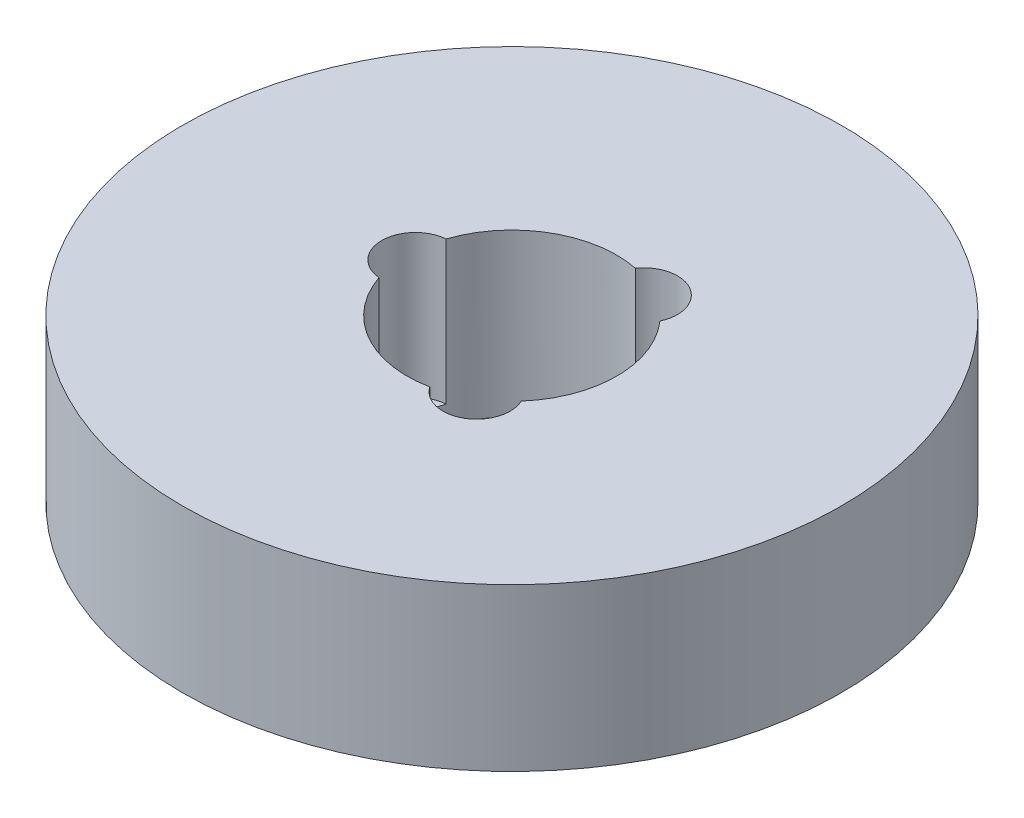
ISO-10303-21;
HEADER;
FILE_DESCRIPTION(('STEP AP214'),'2;1');
FILE_NAME('part.step','',(''),(''),'','','');
FILE_SCHEMA(('AUTOMOTIVE_DESIGN { 1 0 10303 214 1 1 1 1 }'));
ENDSEC;
DATA;
#1=APPLICATION_CONTEXT('core data for automotive mechanical design processes');
#2=APPLICATION_PROTOCOL_DEFINITION('international standard','automotive_design',2000,#1);
#3=PRODUCT_CONTEXT('',#1,'mechanical');
#4=PRODUCT('Part','Part','',(#3));
#5=PRODUCT_RELATED_PRODUCT_CATEGORY('part','',(#4));
#6=PRODUCT_DEFINITION_FORMATION('','',#4);
#7=PRODUCT_DEFINITION_CONTEXT('part definition',#1,'design');
#8=PRODUCT_DEFINITION('design','',#6,#7);
#9=PRODUCT_DEFINITION_SHAPE('','',#8);
#10=(LENGTH_UNIT() NAMED_UNIT(*) SI_UNIT(.MILLI.,.METRE.));
#11=(NAMED_UNIT(*) PLANE_ANGLE_UNIT() SI_UNIT($,.RADIAN.));
#12=(NAMED_UNIT(*) SI_UNIT($,.STERADIAN.) SOLID_ANGLE_UNIT());
#13=UNCERTAINTY_MEASURE_WITH_UNIT(LENGTH_MEASURE(1.E-05),#10,'distance_accuracy_value','');
#14=(GEOMETRIC_REPRESENTATION_CONTEXT(3) GLOBAL_UNCERTAINTY_ASSIGNED_CONTEXT((#13)) GLOBAL_UNIT_ASSIGNED_CONTEXT((#10,
#11,#12)) REPRESENTATION_CONTEXT('',''));
#15=CARTESIAN_POINT('',(0.,0.,0.));
#16=DIRECTION('',(0.,0.,1.));
#17=DIRECTION('',(1.,0.,0.));
#18=AXIS2_PLACEMENT_3D('',#15,#16,#17);
#19=CARTESIAN_POINT('',(0.,27.,0.));
#20=DIRECTION('',(0.,-1.,0.));
#21=DIRECTION('',(0.,0.,-1.));
#22=AXIS2_PLACEMENT_3D('',#19,#20,#21);
#23=CYLINDRICAL_SURFACE('',#22,55.);
#24=CARTESIAN_POINT('',(0.,27.,0.));
#25=DIRECTION('',(0.,1.,0.));
#26=DIRECTION('',(0.,0.,1.));
#27=AXIS2_PLACEMENT_3D('',#24,#25,#26);
#28=CIRCLE('',#27,55.);
#29=CARTESIAN_POINT('',(0.,27.,55.));
#30=VERTEX_POINT('',#29);
#31=EDGE_CURVE('E130',#30,#30,#28,.T.);
#32=ORIENTED_EDGE('',*,*,#31,.F.);
#33=EDGE_LOOP('',(#32));
#34=FACE_BOUND('',#33,.T.);
#35=CARTESIAN_POINT('',(0.,0.,0.));
#36=DIRECTION('',(0.,1.,0.));
#37=DIRECTION('',(0.,0.,1.));
#38=AXIS2_PLACEMENT_3D('',#35,#36,#37);
#39=CIRCLE('',#38,55.);
#40=CARTESIAN_POINT('',(0.,0.,55.));
#41=VERTEX_POINT('',#40);
#42=EDGE_CURVE('E117',#41,#41,#39,.T.);
#43=ORIENTED_EDGE('',*,*,#42,.T.);
#44=EDGE_LOOP('',(#43));
#45=FACE_BOUND('',#44,.T.);
#46=ADVANCED_FACE('F39',(#34,#45),#23,.T.);
#47=CARTESIAN_POINT('',(0.,27.,0.));
#48=DIRECTION('',(0.,1.,0.));
#49=DIRECTION('',(0.,0.,1.));
#50=AXIS2_PLACEMENT_3D('',#47,#48,#49);
#51=PLANE('',#50);
#52=CARTESIAN_POINT('',(8.0588097226221,27.,13.9582678881114));
#53=DIRECTION('',(0.,1.,0.));
#54=DIRECTION('',(0.866025403784436,0.,-0.500000000000004));
#55=AXIS2_PLACEMENT_3D('',#52,#53,#54);
#56=CIRCLE('',#55,5.60914404502101);
#57=CARTESIAN_POINT('',(3.45073244343374,27.,17.156411209919));
#58=VERTEX_POINT('',#57);
#59=CARTESIAN_POINT('',(13.1325217238452,27.,11.5666275626361));
#60=VERTEX_POINT('',#59);
#61=EDGE_CURVE('E148',#58,#60,#56,.T.);
#62=ORIENTED_EDGE('',*,*,#61,.F.);
#63=CARTESIAN_POINT('',(0.,27.,0.));
#64=DIRECTION('',(0.,1.,0.));
#65=DIRECTION('',(0.,0.,1.));
#66=AXIS2_PLACEMENT_3D('',#63,#64,#65);
#67=CIRCLE('',#66,17.5);
#68=CARTESIAN_POINT('',(-16.5832541672788,27.,5.58978364728281));
#69=VERTEX_POINT('',#68);
#70=EDGE_CURVE('E113',#69,#58,#67,.T.);
#71=ORIENTED_EDGE('',*,*,#70,.F.);
#72=CARTESIAN_POINT('',(-16.1176194452441,27.,0.));
#73=DIRECTION('',(0.,1.,0.));
#74=DIRECTION('',(0.,0.,1.));
#75=AXIS2_PLACEMENT_3D('',#72,#73,#74);
#76=CIRCLE('',#75,5.60914404502101);
#77=CARTESIAN_POINT('',(-16.5832541672788,27.,-5.58978364728281));
#78=VERTEX_POINT('',#77);
#79=EDGE_CURVE('E125',#78,#69,#76,.T.);
#80=ORIENTED_EDGE('',*,*,#79,.F.);
#81=CARTESIAN_POINT('',(3.4507324434335,27.,-17.156411209919));
#82=VERTEX_POINT('',#81);
#83=EDGE_CURVE('E107',#82,#78,#67,.T.);
#84=ORIENTED_EDGE('',*,*,#83,.F.);
#85=CARTESIAN_POINT('',(8.05880972262191,27.,-13.9582678881115));
#86=DIRECTION('',(0.,1.,0.));
#87=DIRECTION('',(-0.866025403784443,0.,-0.499999999999992));
#88=AXIS2_PLACEMENT_3D('',#85,#86,#87);
#89=CIRCLE('',#88,5.60914404502101);
#90=CARTESIAN_POINT('',(13.132521723845,27.,-11.5666275626363));
#91=VERTEX_POINT('',#90);
#92=EDGE_CURVE('E95',#91,#82,#89,.T.);
#93=ORIENTED_EDGE('',*,*,#92,.F.);
#94=EDGE_CURVE('E106',#60,#91,#67,.T.);
#95=ORIENTED_EDGE('',*,*,#94,.F.);
#96=EDGE_LOOP('',(#62,#71,#80,#84,#93,#95));
#97=FACE_BOUND('',#96,.T.);
#98=ORIENTED_EDGE('',*,*,#31,.T.);
#99=EDGE_LOOP('',(#98));
#100=FACE_BOUND('',#99,.T.);
#101=ADVANCED_FACE('F102',(#97,#100),#51,.T.);
#102=CARTESIAN_POINT('',(0.,0.,0.));
#103=DIRECTION('',(0.,1.,0.));
#104=DIRECTION('',(0.,0.,1.));
#105=AXIS2_PLACEMENT_3D('',#102,#103,#104);
#106=PLANE('',#105);
#107=CARTESIAN_POINT('',(0.,0.,0.));
#108=DIRECTION('',(0.,1.,0.));
#109=DIRECTION('',(0.,0.,1.));
#110=AXIS2_PLACEMENT_3D('',#107,#108,#109);
#111=CIRCLE('',#110,17.5);
#112=CARTESIAN_POINT('',(0.,0.,17.5));
#113=VERTEX_POINT('',#112);
#114=EDGE_CURVE('E118',#113,#113,#111,.T.);
#115=ORIENTED_EDGE('',*,*,#114,.T.);
#116=EDGE_LOOP('',(#115));
#117=FACE_BOUND('',#116,.T.);
#118=ORIENTED_EDGE('',*,*,#42,.F.);
#119=EDGE_LOOP('',(#118));
#120=FACE_BOUND('',#119,.T.);
#121=ADVANCED_FACE('F161',(#117,#120),#106,.F.);
#122=CARTESIAN_POINT('',(0.,27.,0.));
#123=DIRECTION('',(0.,-1.,0.));
#124=DIRECTION('',(0.,0.,-1.));
#125=AXIS2_PLACEMENT_3D('',#122,#123,#124);
#126=CYLINDRICAL_SURFACE('',#125,17.5);
#127=DIRECTION('',(0.,1.,0.));
#128=VECTOR('',#127,1.);
#129=CARTESIAN_POINT('',(3.45073244343374,15.0699027850837,17.156411209919));
#130=LINE('',#129,#128);
#131=CARTESIAN_POINT('',(3.45073244343374,3.1398055701673,17.156411209919));
#132=VERTEX_POINT('',#131);
#133=EDGE_CURVE('E11',#132,#58,#130,.T.);
#134=ORIENTED_EDGE('',*,*,#133,.F.);
#135=CARTESIAN_POINT('',(0.,3.1398055701673,0.));
#136=DIRECTION('',(0.,1.,0.));
#137=DIRECTION('',(0.,0.,1.));
#138=AXIS2_PLACEMENT_3D('',#135,#136,#137);
#139=CIRCLE('',#138,17.5);
#140=CARTESIAN_POINT('',(13.1325217238452,3.1398055701673,11.5666275626361));
#141=VERTEX_POINT('',#140);
#142=EDGE_CURVE('E100',#132,#141,#139,.T.);
#143=ORIENTED_EDGE('',*,*,#142,.T.);
#144=DIRECTION('',(0.,1.,0.));
#145=VECTOR('',#144,1.);
#146=CARTESIAN_POINT('',(13.1325217238452,15.0699027850837,11.5666275626361));
#147=LINE('',#146,#145);
#148=EDGE_CURVE('E46',#60,#141,#147,.F.);
#149=ORIENTED_EDGE('',*,*,#148,.F.);
#150=ORIENTED_EDGE('',*,*,#94,.T.);
#151=DIRECTION('',(0.,1.,0.));
#152=VECTOR('',#151,1.);
#153=CARTESIAN_POINT('',(13.132521723845,15.0699027850837,-11.5666275626363));
#154=LINE('',#153,#152);
#155=CARTESIAN_POINT('',(13.132521723845,3.1398055701673,-11.5666275626363));
#156=VERTEX_POINT('',#155);
#157=EDGE_CURVE('E90',#156,#91,#154,.T.);
#158=ORIENTED_EDGE('',*,*,#157,.F.);
#159=CARTESIAN_POINT('',(0.,3.1398055701673,0.));
#160=DIRECTION('',(0.,1.,0.));
#161=DIRECTION('',(0.,0.,1.));
#162=AXIS2_PLACEMENT_3D('',#159,#160,#161);
#163=CIRCLE('',#162,17.5);
#164=CARTESIAN_POINT('',(3.4507324434335,3.1398055701673,-17.156411209919));
#165=VERTEX_POINT('',#164);
#166=EDGE_CURVE('E143',#156,#165,#163,.T.);
#167=ORIENTED_EDGE('',*,*,#166,.T.);
#168=DIRECTION('',(0.,1.,0.));
#169=VECTOR('',#168,1.);
#170=CARTESIAN_POINT('',(3.4507324434335,15.0699027850837,-17.156411209919));
#171=LINE('',#170,#169);
#172=EDGE_CURVE('E98',#82,#165,#171,.F.);
#173=ORIENTED_EDGE('',*,*,#172,.F.);
#174=ORIENTED_EDGE('',*,*,#83,.T.);
#175=DIRECTION('',(0.,1.,0.));
#176=VECTOR('',#175,1.);
#177=CARTESIAN_POINT('',(-16.5832541672788,15.0699027850837,-5.58978364728281));
#178=LINE('',#177,#176);
#179=CARTESIAN_POINT('',(-16.5832541672788,3.1398055701673,-5.58978364728281));
#180=VERTEX_POINT('',#179);
#181=EDGE_CURVE('E137',#180,#78,#178,.T.);
#182=ORIENTED_EDGE('',*,*,#181,.F.);
#183=CARTESIAN_POINT('',(0.,3.1398055701673,0.));
#184=DIRECTION('',(0.,1.,0.));
#185=DIRECTION('',(0.,0.,1.));
#186=AXIS2_PLACEMENT_3D('',#183,#184,#185);
#187=CIRCLE('',#186,17.5);
#188=CARTESIAN_POINT('',(-16.5832541672788,3.1398055701673,5.58978364728281));
#189=VERTEX_POINT('',#188);
#190=EDGE_CURVE('E128',#180,#189,#187,.T.);
#191=ORIENTED_EDGE('',*,*,#190,.T.);
#192=DIRECTION('',(0.,1.,0.));
#193=VECTOR('',#192,1.);
#194=CARTESIAN_POINT('',(-16.5832541672788,15.0699027850837,5.58978364728281));
#195=LINE('',#194,#193);
#196=EDGE_CURVE('E134',#69,#189,#195,.F.);
#197=ORIENTED_EDGE('',*,*,#196,.F.);
#198=ORIENTED_EDGE('',*,*,#70,.T.);
#199=EDGE_LOOP('',(#134,#143,#149,#150,#158,#167,#173,#174,#182,#191,#197,#198));
#200=FACE_BOUND('',#199,.T.);
#201=ORIENTED_EDGE('',*,*,#114,.F.);
#202=EDGE_LOOP('',(#201));
#203=FACE_BOUND('',#202,.T.);
#204=ADVANCED_FACE('F115',(#200,#203),#126,.F.);
#205=CARTESIAN_POINT('',(-16.1176194452441,3.1398055701673,0.));
#206=DIRECTION('',(0.,1.,0.));
#207=DIRECTION('',(0.,0.,1.));
#208=AXIS2_PLACEMENT_3D('',#205,#206,#207);
#209=CYLINDRICAL_SURFACE('',#208,5.60914404502101);
#210=ORIENTED_EDGE('',*,*,#181,.T.);
#211=ORIENTED_EDGE('',*,*,#79,.T.);
#212=ORIENTED_EDGE('',*,*,#196,.T.);
#213=CARTESIAN_POINT('',(-16.1176194452441,3.1398055701673,0.));
#214=DIRECTION('',(0.,1.,0.));
#215=DIRECTION('',(0.,0.,1.));
#216=AXIS2_PLACEMENT_3D('',#213,#214,#215);
#217=CIRCLE('',#216,5.60914404502101);
#218=EDGE_CURVE('E127',#180,#189,#217,.T.);
#219=ORIENTED_EDGE('',*,*,#218,.F.);
#220=EDGE_LOOP('',(#210,#211,#212,#219));
#221=FACE_BOUND('',#220,.T.);
#222=ADVANCED_FACE('F175',(#221),#209,.F.);
#223=CARTESIAN_POINT('',(-16.1176194452441,3.1398055701673,0.));
#224=DIRECTION('',(0.,1.,0.));
#225=DIRECTION('',(0.,0.,1.));
#226=AXIS2_PLACEMENT_3D('',#223,#224,#225);
#227=PLANE('',#226);
#228=ORIENTED_EDGE('',*,*,#218,.T.);
#229=ORIENTED_EDGE('',*,*,#190,.F.);
#230=EDGE_LOOP('',(#228,#229));
#231=FACE_BOUND('',#230,.T.);
#232=ADVANCED_FACE('F176',(#231),#227,.T.);
#233=CARTESIAN_POINT('',(8.05880972262191,3.1398055701673,-13.9582678881115));
#234=DIRECTION('',(0.,1.,0.));
#235=DIRECTION('',(0.,0.,1.));
#236=AXIS2_PLACEMENT_3D('',#233,#234,#235);
#237=CYLINDRICAL_SURFACE('',#236,5.60914404502101);
#238=ORIENTED_EDGE('',*,*,#157,.T.);
#239=ORIENTED_EDGE('',*,*,#92,.T.);
#240=ORIENTED_EDGE('',*,*,#172,.T.);
#241=CARTESIAN_POINT('',(8.05880972262191,3.1398055701673,-13.9582678881115));
#242=DIRECTION('',(0.,1.,0.));
#243=DIRECTION('',(-0.866025403784443,0.,-0.499999999999992));
#244=AXIS2_PLACEMENT_3D('',#241,#242,#243);
#245=CIRCLE('',#244,5.60914404502101);
#246=EDGE_CURVE('E56',#156,#165,#245,.T.);
#247=ORIENTED_EDGE('',*,*,#246,.F.);
#248=EDGE_LOOP('',(#238,#239,#240,#247));
#249=FACE_BOUND('',#248,.T.);
#250=ADVANCED_FACE('F93',(#249),#237,.F.);
#251=CARTESIAN_POINT('',(8.05880972262191,3.1398055701673,-13.9582678881115));
#252=DIRECTION('',(0.,1.,0.));
#253=DIRECTION('',(-0.866025403784443,0.,-0.499999999999992));
#254=AXIS2_PLACEMENT_3D('',#251,#252,#253);
#255=PLANE('',#254);
#256=ORIENTED_EDGE('',*,*,#246,.T.);
#257=ORIENTED_EDGE('',*,*,#166,.F.);
#258=EDGE_LOOP('',(#256,#257));
#259=FACE_BOUND('',#258,.T.);
#260=ADVANCED_FACE('F153',(#259),#255,.T.);
#261=CARTESIAN_POINT('',(8.0588097226221,3.1398055701673,13.9582678881114));
#262=DIRECTION('',(0.,1.,0.));
#263=DIRECTION('',(0.,0.,1.));
#264=AXIS2_PLACEMENT_3D('',#261,#262,#263);
#265=CYLINDRICAL_SURFACE('',#264,5.60914404502101);
#266=ORIENTED_EDGE('',*,*,#133,.T.);
#267=ORIENTED_EDGE('',*,*,#61,.T.);
#268=ORIENTED_EDGE('',*,*,#148,.T.);
#269=CARTESIAN_POINT('',(8.0588097226221,3.1398055701673,13.9582678881114));
#270=DIRECTION('',(0.,1.,0.));
#271=DIRECTION('',(0.866025403784436,0.,-0.500000000000004));
#272=AXIS2_PLACEMENT_3D('',#269,#270,#271);
#273=CIRCLE('',#272,5.60914404502101);
#274=EDGE_CURVE('E55',#132,#141,#273,.T.);
#275=ORIENTED_EDGE('',*,*,#274,.F.);
#276=EDGE_LOOP('',(#266,#267,#268,#275));
#277=FACE_BOUND('',#276,.T.);
#278=ADVANCED_FACE('F144',(#277),#265,.F.);
#279=CARTESIAN_POINT('',(8.0588097226221,3.1398055701673,13.9582678881114));
#280=DIRECTION('',(0.,1.,0.));
#281=DIRECTION('',(0.866025403784436,0.,-0.500000000000004));
#282=AXIS2_PLACEMENT_3D('',#279,#280,#281);
#283=PLANE('',#282);
#284=ORIENTED_EDGE('',*,*,#274,.T.);
#285=ORIENTED_EDGE('',*,*,#142,.F.);
#286=EDGE_LOOP('',(#284,#285));
#287=FACE_BOUND('',#286,.T.);
#288=ADVANCED_FACE('F150',(#287),#283,.T.);
#289=CLOSED_SHELL('',(#46,#101,#121,#204,#222,#232,#250,#260,#278,#288));
#290=MANIFOLD_SOLID_BREP('B2',#289);
#291=ADVANCED_BREP_SHAPE_REPRESENTATION('',(#18,#290),#14);
#292=SHAPE_DEFINITION_REPRESENTATION(#9,#291);
ENDSEC;
END-ISO-10303-21;
